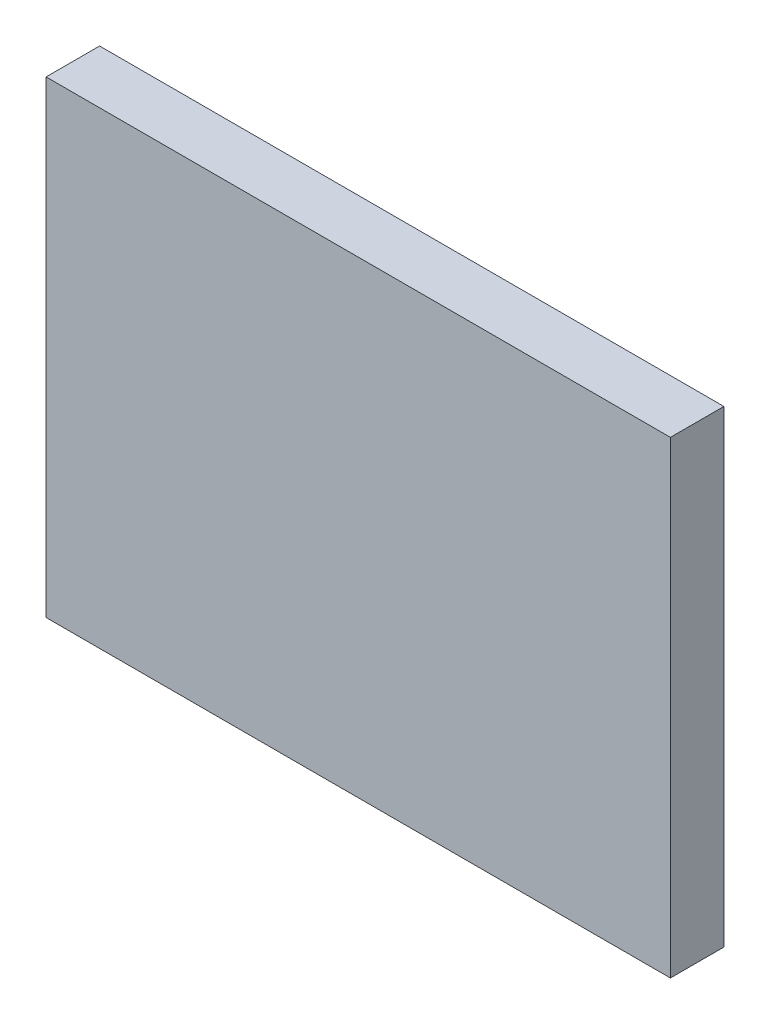
ISO-10303-21;
HEADER;
FILE_DESCRIPTION(('STEP AP214'),'2;1');
FILE_NAME('part.step','',(''),(''),'','','');
FILE_SCHEMA(('AUTOMOTIVE_DESIGN { 1 0 10303 214 1 1 1 1 }'));
ENDSEC;
DATA;
#1=APPLICATION_CONTEXT('core data for automotive mechanical design processes');
#2=APPLICATION_PROTOCOL_DEFINITION('international standard','automotive_design',2000,#1);
#3=PRODUCT_CONTEXT('',#1,'mechanical');
#4=PRODUCT('Part','Part','',(#3));
#5=PRODUCT_RELATED_PRODUCT_CATEGORY('part','',(#4));
#6=PRODUCT_DEFINITION_FORMATION('','',#4);
#7=PRODUCT_DEFINITION_CONTEXT('part definition',#1,'design');
#8=PRODUCT_DEFINITION('design','',#6,#7);
#9=PRODUCT_DEFINITION_SHAPE('','',#8);
#10=(LENGTH_UNIT() NAMED_UNIT(*) SI_UNIT(.MILLI.,.METRE.));
#11=(NAMED_UNIT(*) PLANE_ANGLE_UNIT() SI_UNIT($,.RADIAN.));
#12=(NAMED_UNIT(*) SI_UNIT($,.STERADIAN.) SOLID_ANGLE_UNIT());
#13=UNCERTAINTY_MEASURE_WITH_UNIT(LENGTH_MEASURE(1.E-05),#10,'distance_accuracy_value','');
#14=(GEOMETRIC_REPRESENTATION_CONTEXT(3) GLOBAL_UNCERTAINTY_ASSIGNED_CONTEXT((#13)) GLOBAL_UNIT_ASSIGNED_CONTEXT((#10,
#11,#12)) REPRESENTATION_CONTEXT('',''));
#15=CARTESIAN_POINT('',(0.,0.,0.));
#16=DIRECTION('',(0.,0.,1.));
#17=DIRECTION('',(1.,0.,0.));
#18=AXIS2_PLACEMENT_3D('',#15,#16,#17);
#19=CARTESIAN_POINT('',(2.28346,2.81364,0.76487));
#20=DIRECTION('',(0.,0.,-1.));
#21=DIRECTION('',(-1.,0.,0.));
#22=AXIS2_PLACEMENT_3D('',#19,#20,#21);
#23=PLANE('',#22);
#24=DIRECTION('',(1.,0.,0.));
#25=VECTOR('',#24,1.);
#26=CARTESIAN_POINT('',(2.08346,2.96364,0.76487));
#27=LINE('',#26,#25);
#28=CARTESIAN_POINT('',(2.08346,2.96364,0.76487));
#29=VERTEX_POINT('',#28);
#30=CARTESIAN_POINT('',(2.48346,2.96364,0.76487));
#31=VERTEX_POINT('',#30);
#32=EDGE_CURVE('E55',#29,#31,#27,.T.);
#33=ORIENTED_EDGE('',*,*,#32,.T.);
#34=DIRECTION('',(0.,1.,0.));
#35=VECTOR('',#34,1.);
#36=CARTESIAN_POINT('',(2.48346,2.96364,0.76487));
#37=LINE('',#36,#35);
#38=CARTESIAN_POINT('',(2.48346,2.66364,0.76487));
#39=VERTEX_POINT('',#38);
#40=EDGE_CURVE('E57',#31,#39,#37,.F.);
#41=ORIENTED_EDGE('',*,*,#40,.T.);
#42=DIRECTION('',(1.,0.,0.));
#43=VECTOR('',#42,1.);
#44=CARTESIAN_POINT('',(2.48346,2.66364,0.76487));
#45=LINE('',#44,#43);
#46=CARTESIAN_POINT('',(2.08346,2.66364,0.76487));
#47=VERTEX_POINT('',#46);
#48=EDGE_CURVE('E20',#39,#47,#45,.F.);
#49=ORIENTED_EDGE('',*,*,#48,.T.);
#50=DIRECTION('',(0.,1.,0.));
#51=VECTOR('',#50,1.);
#52=CARTESIAN_POINT('',(2.08346,2.66364,0.76487));
#53=LINE('',#52,#51);
#54=EDGE_CURVE('E80',#47,#29,#53,.T.);
#55=ORIENTED_EDGE('',*,*,#54,.T.);
#56=EDGE_LOOP('',(#33,#41,#49,#55));
#57=FACE_BOUND('',#56,.T.);
#58=ADVANCED_FACE('F17',(#57),#23,.T.);
#59=CARTESIAN_POINT('',(2.48346,2.66364,0.76487));
#60=DIRECTION('',(0.,1.,0.));
#61=DIRECTION('',(0.,0.,1.));
#62=AXIS2_PLACEMENT_3D('',#59,#60,#61);
#63=PLANE('',#62);
#64=DIRECTION('',(0.,0.,1.));
#65=VECTOR('',#64,1.);
#66=CARTESIAN_POINT('',(2.08346,2.66364,0.76487));
#67=LINE('',#66,#65);
#68=CARTESIAN_POINT('',(2.08346,2.66364,0.79916));
#69=VERTEX_POINT('',#68);
#70=EDGE_CURVE('E68',#69,#47,#67,.F.);
#71=ORIENTED_EDGE('',*,*,#70,.T.);
#72=ORIENTED_EDGE('',*,*,#48,.F.);
#73=DIRECTION('',(0.,0.,1.));
#74=VECTOR('',#73,1.);
#75=CARTESIAN_POINT('',(2.48346,2.66364,0.76487));
#76=LINE('',#75,#74);
#77=CARTESIAN_POINT('',(2.48346,2.66364,0.79916));
#78=VERTEX_POINT('',#77);
#79=EDGE_CURVE('E63',#39,#78,#76,.T.);
#80=ORIENTED_EDGE('',*,*,#79,.T.);
#81=DIRECTION('',(1.,0.,0.));
#82=VECTOR('',#81,1.);
#83=CARTESIAN_POINT('',(2.28346,2.66364,0.79916));
#84=LINE('',#83,#82);
#85=EDGE_CURVE('E83',#69,#78,#84,.T.);
#86=ORIENTED_EDGE('',*,*,#85,.F.);
#87=EDGE_LOOP('',(#71,#72,#80,#86));
#88=FACE_BOUND('',#87,.T.);
#89=ADVANCED_FACE('F65',(#88),#63,.F.);
#90=CARTESIAN_POINT('',(2.48346,2.96364,0.76487));
#91=DIRECTION('',(-1.,0.,0.));
#92=DIRECTION('',(0.,0.,1.));
#93=AXIS2_PLACEMENT_3D('',#90,#91,#92);
#94=PLANE('',#93);
#95=ORIENTED_EDGE('',*,*,#79,.F.);
#96=ORIENTED_EDGE('',*,*,#40,.F.);
#97=DIRECTION('',(0.,0.,-1.));
#98=VECTOR('',#97,1.);
#99=CARTESIAN_POINT('',(2.48346,2.96364,0.76487));
#100=LINE('',#99,#98);
#101=CARTESIAN_POINT('',(2.48346,2.96364,0.79916));
#102=VERTEX_POINT('',#101);
#103=EDGE_CURVE('E75',#31,#102,#100,.F.);
#104=ORIENTED_EDGE('',*,*,#103,.T.);
#105=DIRECTION('',(0.,-1.,0.));
#106=VECTOR('',#105,1.);
#107=CARTESIAN_POINT('',(2.48346,2.81364,0.79916));
#108=LINE('',#107,#106);
#109=EDGE_CURVE('E72',#78,#102,#108,.F.);
#110=ORIENTED_EDGE('',*,*,#109,.F.);
#111=EDGE_LOOP('',(#95,#96,#104,#110));
#112=FACE_BOUND('',#111,.T.);
#113=ADVANCED_FACE('F70',(#112),#94,.F.);
#114=CARTESIAN_POINT('',(2.08346,2.96364,0.76487));
#115=DIRECTION('',(0.,-1.,0.));
#116=DIRECTION('',(0.,0.,-1.));
#117=AXIS2_PLACEMENT_3D('',#114,#115,#116);
#118=PLANE('',#117);
#119=ORIENTED_EDGE('',*,*,#103,.F.);
#120=ORIENTED_EDGE('',*,*,#32,.F.);
#121=DIRECTION('',(0.,0.,1.));
#122=VECTOR('',#121,1.);
#123=CARTESIAN_POINT('',(2.08346,2.96364,0.76487));
#124=LINE('',#123,#122);
#125=CARTESIAN_POINT('',(2.08346,2.96364,0.79916));
#126=VERTEX_POINT('',#125);
#127=EDGE_CURVE('E35',#29,#126,#124,.T.);
#128=ORIENTED_EDGE('',*,*,#127,.T.);
#129=DIRECTION('',(1.,0.,0.));
#130=VECTOR('',#129,1.);
#131=CARTESIAN_POINT('',(2.28346,2.96364,0.79916));
#132=LINE('',#131,#130);
#133=EDGE_CURVE('E26',#102,#126,#132,.F.);
#134=ORIENTED_EDGE('',*,*,#133,.F.);
#135=EDGE_LOOP('',(#119,#120,#128,#134));
#136=FACE_BOUND('',#135,.T.);
#137=ADVANCED_FACE('F89',(#136),#118,.F.);
#138=CARTESIAN_POINT('',(2.08346,2.66364,0.76487));
#139=DIRECTION('',(1.,0.,0.));
#140=DIRECTION('',(0.,1.,0.));
#141=AXIS2_PLACEMENT_3D('',#138,#139,#140);
#142=PLANE('',#141);
#143=ORIENTED_EDGE('',*,*,#127,.F.);
#144=ORIENTED_EDGE('',*,*,#54,.F.);
#145=ORIENTED_EDGE('',*,*,#70,.F.);
#146=DIRECTION('',(0.,-1.,0.));
#147=VECTOR('',#146,1.);
#148=CARTESIAN_POINT('',(2.08346,2.81364,0.79916));
#149=LINE('',#148,#147);
#150=EDGE_CURVE('E11',#126,#69,#149,.T.);
#151=ORIENTED_EDGE('',*,*,#150,.F.);
#152=EDGE_LOOP('',(#143,#144,#145,#151));
#153=FACE_BOUND('',#152,.T.);
#154=ADVANCED_FACE('F91',(#153),#142,.F.);
#155=CARTESIAN_POINT('',(2.28346,2.81364,0.79916));
#156=DIRECTION('',(0.,0.,1.));
#157=DIRECTION('',(0.,-1.,0.));
#158=AXIS2_PLACEMENT_3D('',#155,#156,#157);
#159=PLANE('',#158);
#160=ORIENTED_EDGE('',*,*,#133,.T.);
#161=ORIENTED_EDGE('',*,*,#150,.T.);
#162=ORIENTED_EDGE('',*,*,#85,.T.);
#163=ORIENTED_EDGE('',*,*,#109,.T.);
#164=EDGE_LOOP('',(#160,#161,#162,#163));
#165=FACE_BOUND('',#164,.T.);
#166=ADVANCED_FACE('F88',(#165),#159,.T.);
#167=CLOSED_SHELL('',(#58,#89,#113,#137,#154,#166));
#168=MANIFOLD_SOLID_BREP('B1',#167);
#169=ADVANCED_BREP_SHAPE_REPRESENTATION('',(#18,#168),#14);
#170=SHAPE_DEFINITION_REPRESENTATION(#9,#169);
ENDSEC;
END-ISO-10303-21;
